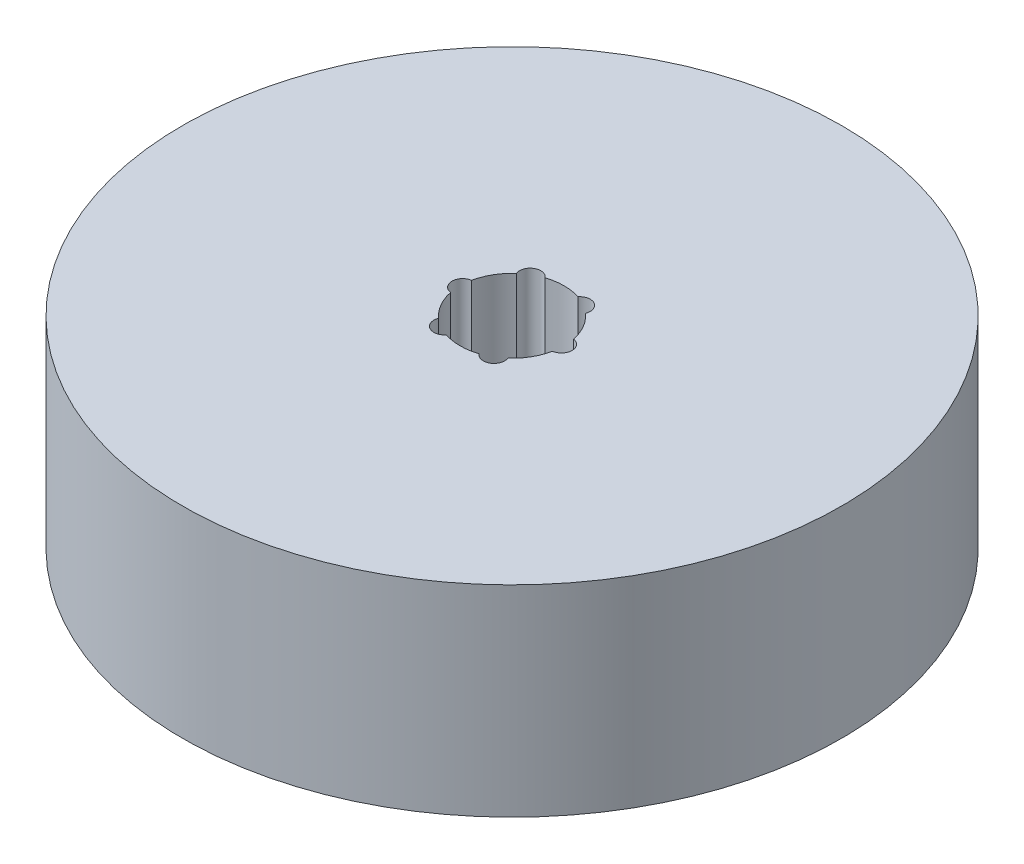
ISO-10303-21;
HEADER;
FILE_DESCRIPTION(('STEP AP214'),'2;1');
FILE_NAME('part.step','',(''),(''),'','','');
FILE_SCHEMA(('AUTOMOTIVE_DESIGN { 1 0 10303 214 1 1 1 1 }'));
ENDSEC;
DATA;
#1=APPLICATION_CONTEXT('core data for automotive mechanical design processes');
#2=APPLICATION_PROTOCOL_DEFINITION('international standard','automotive_design',2000,#1);
#3=PRODUCT_CONTEXT('',#1,'mechanical');
#4=PRODUCT('Part','Part','',(#3));
#5=PRODUCT_RELATED_PRODUCT_CATEGORY('part','',(#4));
#6=PRODUCT_DEFINITION_FORMATION('','',#4);
#7=PRODUCT_DEFINITION_CONTEXT('part definition',#1,'design');
#8=PRODUCT_DEFINITION('design','',#6,#7);
#9=PRODUCT_DEFINITION_SHAPE('','',#8);
#10=(LENGTH_UNIT() NAMED_UNIT(*) SI_UNIT(.MILLI.,.METRE.));
#11=(NAMED_UNIT(*) PLANE_ANGLE_UNIT() SI_UNIT($,.RADIAN.));
#12=(NAMED_UNIT(*) SI_UNIT($,.STERADIAN.) SOLID_ANGLE_UNIT());
#13=UNCERTAINTY_MEASURE_WITH_UNIT(LENGTH_MEASURE(1.E-05),#10,'distance_accuracy_value','');
#14=(GEOMETRIC_REPRESENTATION_CONTEXT(3) GLOBAL_UNCERTAINTY_ASSIGNED_CONTEXT((#13)) GLOBAL_UNIT_ASSIGNED_CONTEXT((#10,
#11,#12)) REPRESENTATION_CONTEXT('',''));
#15=CARTESIAN_POINT('',(0.,0.,0.));
#16=DIRECTION('',(0.,0.,1.));
#17=DIRECTION('',(1.,0.,0.));
#18=AXIS2_PLACEMENT_3D('',#15,#16,#17);
#19=CARTESIAN_POINT('',(0.,29.,0.));
#20=DIRECTION('',(0.,-1.,0.));
#21=DIRECTION('',(0.,0.,-1.));
#22=AXIS2_PLACEMENT_3D('',#19,#20,#21);
#23=CYLINDRICAL_SURFACE('',#22,47.5);
#24=CARTESIAN_POINT('',(0.,29.,0.));
#25=DIRECTION('',(0.,1.,0.));
#26=DIRECTION('',(0.,0.,1.));
#27=AXIS2_PLACEMENT_3D('',#24,#25,#26);
#28=CIRCLE('',#27,47.5);
#29=CARTESIAN_POINT('',(0.,29.,-47.5));
#30=VERTEX_POINT('',#29);
#31=EDGE_CURVE('E162',#30,#30,#28,.T.);
#32=CARTESIAN_POINT('',(0.,0.,0.));
#33=DIRECTION('',(0.,1.,0.));
#34=DIRECTION('',(0.,0.,1.));
#35=AXIS2_PLACEMENT_3D('',#32,#33,#34);
#36=CIRCLE('',#35,47.5);
#37=CARTESIAN_POINT('',(0.,0.,-47.5));
#38=VERTEX_POINT('',#37);
#39=EDGE_CURVE('E157',#38,#38,#36,.T.);
#40=CARTESIAN_POINT('',(0.,29.,-47.5));
#41=CARTESIAN_POINT('',(0.,28.6979166666667,-47.5));
#42=CARTESIAN_POINT('',(0.,28.3958333333333,-47.5));
#43=CARTESIAN_POINT('',(0.,27.7916666666667,-47.5));
#44=CARTESIAN_POINT('',(0.,27.4895833333333,-47.5));
#45=CARTESIAN_POINT('',(0.,26.8854166666667,-47.5));
#46=CARTESIAN_POINT('',(0.,26.5833333333333,-47.5));
#47=CARTESIAN_POINT('',(0.,25.9791666666667,-47.5));
#48=CARTESIAN_POINT('',(0.,25.6770833333333,-47.5));
#49=CARTESIAN_POINT('',(0.,25.0729166666667,-47.5));
#50=CARTESIAN_POINT('',(0.,24.7708333333333,-47.5));
#51=CARTESIAN_POINT('',(0.,24.1666666666667,-47.5));
#52=CARTESIAN_POINT('',(0.,23.8645833333333,-47.5));
#53=CARTESIAN_POINT('',(0.,23.2604166666667,-47.5));
#54=CARTESIAN_POINT('',(0.,22.9583333333333,-47.5));
#55=CARTESIAN_POINT('',(0.,22.3541666666667,-47.5));
#56=CARTESIAN_POINT('',(0.,22.0520833333333,-47.5));
#57=CARTESIAN_POINT('',(0.,21.4479166666667,-47.5));
#58=CARTESIAN_POINT('',(0.,21.1458333333333,-47.5));
#59=CARTESIAN_POINT('',(0.,20.5416666666667,-47.5));
#60=CARTESIAN_POINT('',(0.,20.2395833333333,-47.5));
#61=CARTESIAN_POINT('',(0.,19.6354166666667,-47.5));
#62=CARTESIAN_POINT('',(0.,19.3333333333333,-47.5));
#63=CARTESIAN_POINT('',(0.,18.7291666666667,-47.5));
#64=CARTESIAN_POINT('',(0.,18.4270833333333,-47.5));
#65=CARTESIAN_POINT('',(0.,17.8229166666667,-47.5));
#66=CARTESIAN_POINT('',(0.,17.5208333333333,-47.5));
#67=CARTESIAN_POINT('',(0.,16.9166666666667,-47.5));
#68=CARTESIAN_POINT('',(0.,16.6145833333333,-47.5));
#69=CARTESIAN_POINT('',(0.,16.0104166666667,-47.5));
#70=CARTESIAN_POINT('',(0.,15.7083333333333,-47.5));
#71=CARTESIAN_POINT('',(0.,15.1041666666667,-47.5));
#72=CARTESIAN_POINT('',(0.,14.8020833333333,-47.5));
#73=CARTESIAN_POINT('',(0.,14.1979166666667,-47.5));
#74=CARTESIAN_POINT('',(0.,13.8958333333333,-47.5));
#75=CARTESIAN_POINT('',(0.,13.2916666666667,-47.5));
#76=CARTESIAN_POINT('',(0.,12.9895833333333,-47.5));
#77=CARTESIAN_POINT('',(0.,12.3854166666667,-47.5));
#78=CARTESIAN_POINT('',(0.,12.0833333333333,-47.5));
#79=CARTESIAN_POINT('',(0.,11.4791666666667,-47.5));
#80=CARTESIAN_POINT('',(0.,11.1770833333333,-47.5));
#81=CARTESIAN_POINT('',(0.,10.5729166666667,-47.5));
#82=CARTESIAN_POINT('',(0.,10.2708333333333,-47.5));
#83=CARTESIAN_POINT('',(0.,9.66666666666667,-47.5));
#84=CARTESIAN_POINT('',(0.,9.36458333333333,-47.5));
#85=CARTESIAN_POINT('',(0.,8.76041666666667,-47.5));
#86=CARTESIAN_POINT('',(0.,8.45833333333333,-47.5));
#87=CARTESIAN_POINT('',(0.,7.85416666666667,-47.5));
#88=CARTESIAN_POINT('',(0.,7.55208333333333,-47.5));
#89=CARTESIAN_POINT('',(0.,6.94791666666667,-47.5));
#90=CARTESIAN_POINT('',(0.,6.64583333333333,-47.5));
#91=CARTESIAN_POINT('',(0.,6.04166666666667,-47.5));
#92=CARTESIAN_POINT('',(0.,5.73958333333333,-47.5));
#93=CARTESIAN_POINT('',(0.,5.13541666666667,-47.5));
#94=CARTESIAN_POINT('',(0.,4.83333333333333,-47.5));
#95=CARTESIAN_POINT('',(0.,4.22916666666667,-47.5));
#96=CARTESIAN_POINT('',(0.,3.92708333333333,-47.5));
#97=CARTESIAN_POINT('',(0.,3.32291666666667,-47.5));
#98=CARTESIAN_POINT('',(0.,3.02083333333333,-47.5));
#99=CARTESIAN_POINT('',(0.,2.41666666666667,-47.5));
#100=CARTESIAN_POINT('',(0.,2.11458333333333,-47.5));
#101=CARTESIAN_POINT('',(0.,1.51041666666667,-47.5));
#102=CARTESIAN_POINT('',(0.,1.20833333333333,-47.5));
#103=CARTESIAN_POINT('',(0.,0.604166666666667,-47.5));
#104=CARTESIAN_POINT('',(0.,0.302083333333333,-47.5));
#105=CARTESIAN_POINT('',(0.,0.,-47.5));
#106=B_SPLINE_CURVE_WITH_KNOTS('',3,(#40,#41,#42,#43,#44,#45,#46,#47,#48,#49,#50,#51,#52,#53,
#54,#55,#56,#57,#58,#59,#60,#61,#62,#63,#64,#65,#66,#67,#68,#69,#70,#71,#72,#73,#74,#75,#76,#77,
#78,#79,#80,#81,#82,#83,#84,#85,#86,#87,#88,#89,#90,#91,#92,#93,#94,#95,#96,#97,#98,#99,#100,
#101,#102,#103,#104,#105),.UNSPECIFIED.,.F.,.F.,(4,2,2,2,2,2,2,2,2,2,2,2,2,2,2,2,2,2,2,2,2,2,2,
2,2,2,2,2,2,2,2,2,4),(0.,0.906249999999997,1.8125,2.71875,3.625,4.53125,5.4375,6.34375,7.25,
8.15625,9.0625,9.96875,10.875,11.78125,12.6875,13.59375,14.5,15.40625,16.3125,17.21875,18.125,
19.03125,19.9375,20.84375,21.75,22.65625,23.5625,24.46875,25.375,26.28125,27.1875,28.09375,29.),.UNSPECIFIED.);
#107=EDGE_CURVE('BSEAM39',#30,#38,#106,.T.);
#108=ORIENTED_EDGE('',*,*,#31,.F.);
#109=ORIENTED_EDGE('',*,*,#39,.T.);
#110=ORIENTED_EDGE('',*,*,#107,.T.);
#111=ORIENTED_EDGE('',*,*,#107,.F.);
#112=EDGE_LOOP('',(#108,#110,#109,#111));
#113=FACE_BOUND('',#112,.T.);
#114=ADVANCED_FACE('F39',(#113),#23,.T.);
#115=CARTESIAN_POINT('',(0.,29.,0.));
#116=DIRECTION('',(0.,1.,0.));
#117=DIRECTION('',(0.,0.,1.));
#118=AXIS2_PLACEMENT_3D('',#115,#116,#117);
#119=PLANE('',#118);
#120=CARTESIAN_POINT('',(-3.56245710379145,29.,-6.17035670355129));
#121=DIRECTION('',(0.,1.,0.));
#122=DIRECTION('',(-0.866025403784433,0.,0.50000000000001));
#123=AXIS2_PLACEMENT_3D('',#120,#121,#122);
#124=CIRCLE('',#123,1.5335488822873);
#125=CARTESIAN_POINT('',(-2.35805217393656,29.,-7.11966220722536));
#126=VERTEX_POINT('',#125);
#127=CARTESIAN_POINT('',(-4.986782250853,29.,-5.60196418969075));
#128=VERTEX_POINT('',#127);
#129=EDGE_CURVE('E218',#126,#128,#124,.T.);
#130=ORIENTED_EDGE('',*,*,#129,.F.);
#131=CARTESIAN_POINT('',(0.,29.,0.));
#132=DIRECTION('',(0.,1.,0.));
#133=DIRECTION('',(0.,0.,1.));
#134=AXIS2_PLACEMENT_3D('',#131,#132,#133);
#135=CIRCLE('',#134,7.5);
#136=CARTESIAN_POINT('',(2.35805217393641,29.,-7.11966220722541));
#137=VERTEX_POINT('',#136);
#138=EDGE_CURVE('E169',#137,#126,#135,.T.);
#139=ORIENTED_EDGE('',*,*,#138,.F.);
#140=CARTESIAN_POINT('',(3.56245710379132,29.,-6.17035670355137));
#141=DIRECTION('',(0.,1.,0.));
#142=DIRECTION('',(-0.866025403784443,0.,-0.499999999999992));
#143=AXIS2_PLACEMENT_3D('',#140,#141,#142);
#144=CIRCLE('',#143,1.5335488822873);
#145=CARTESIAN_POINT('',(4.98678225085288,29.,-5.60196418969085));
#146=VERTEX_POINT('',#145);
#147=EDGE_CURVE('E285',#146,#137,#144,.T.);
#148=ORIENTED_EDGE('',*,*,#147,.F.);
#149=CARTESIAN_POINT('',(7.34483442478941,29.,-1.51769801753458));
#150=VERTEX_POINT('',#149);
#151=EDGE_CURVE('E174',#150,#146,#135,.T.);
#152=ORIENTED_EDGE('',*,*,#151,.F.);
#153=CARTESIAN_POINT('',(7.12491420758275,29.,0.));
#154=DIRECTION('',(0.,1.,0.));
#155=DIRECTION('',(0.,0.,-1.));
#156=AXIS2_PLACEMENT_3D('',#153,#154,#155);
#157=CIRCLE('',#156,1.5335488822873);
#158=CARTESIAN_POINT('',(7.34483442478941,29.,1.51769801753458));
#159=VERTEX_POINT('',#158);
#160=EDGE_CURVE('E280',#159,#150,#157,.T.);
#161=ORIENTED_EDGE('',*,*,#160,.F.);
#162=CARTESIAN_POINT('',(4.98678225085296,29.,5.60196418969078));
#163=VERTEX_POINT('',#162);
#164=EDGE_CURVE('E164',#163,#159,#135,.T.);
#165=ORIENTED_EDGE('',*,*,#164,.F.);
#166=CARTESIAN_POINT('',(3.56245710379141,29.,6.17035670355132));
#167=DIRECTION('',(0.,1.,0.));
#168=DIRECTION('',(0.866025403784436,0.,-0.500000000000004));
#169=AXIS2_PLACEMENT_3D('',#166,#167,#168);
#170=CIRCLE('',#169,1.5335488822873);
#171=CARTESIAN_POINT('',(2.35805217393651,29.,7.11966220722537));
#172=VERTEX_POINT('',#171);
#173=EDGE_CURVE('E269',#172,#163,#170,.T.);
#174=ORIENTED_EDGE('',*,*,#173,.F.);
#175=CARTESIAN_POINT('',(-2.35805217393646,29.,7.11966220722539));
#176=VERTEX_POINT('',#175);
#177=EDGE_CURVE('E149',#176,#172,#135,.T.);
#178=ORIENTED_EDGE('',*,*,#177,.F.);
#179=CARTESIAN_POINT('',(-3.56245710379136,29.,6.17035670355135));
#180=DIRECTION('',(0.,1.,0.));
#181=DIRECTION('',(0.86602540378444,0.,0.499999999999998));
#182=AXIS2_PLACEMENT_3D('',#179,#180,#181);
#183=CIRCLE('',#182,1.5335488822873);
#184=CARTESIAN_POINT('',(-4.98678225085292,29.,5.60196418969082));
#185=VERTEX_POINT('',#184);
#186=EDGE_CURVE('E128',#185,#176,#183,.T.);
#187=ORIENTED_EDGE('',*,*,#186,.F.);
#188=CARTESIAN_POINT('',(-7.34483442478941,29.,1.51769801753458));
#189=VERTEX_POINT('',#188);
#190=EDGE_CURVE('E148',#189,#185,#135,.T.);
#191=ORIENTED_EDGE('',*,*,#190,.F.);
#192=CARTESIAN_POINT('',(-7.12491420758275,29.,0.));
#193=DIRECTION('',(0.,1.,0.));
#194=DIRECTION('',(0.,0.,1.));
#195=AXIS2_PLACEMENT_3D('',#192,#193,#194);
#196=CIRCLE('',#195,1.5335488822873);
#197=CARTESIAN_POINT('',(-7.34483442478941,29.,-1.51769801753458));
#198=VERTEX_POINT('',#197);
#199=EDGE_CURVE('E179',#198,#189,#196,.T.);
#200=ORIENTED_EDGE('',*,*,#199,.F.);
#201=EDGE_CURVE('E161',#128,#198,#135,.T.);
#202=ORIENTED_EDGE('',*,*,#201,.F.);
#203=EDGE_LOOP('',(#130,#139,#148,#152,#161,#165,#174,#178,#187,#191,#200,#202));
#204=FACE_BOUND('',#203,.T.);
#205=ORIENTED_EDGE('',*,*,#31,.T.);
#206=EDGE_LOOP('',(#205));
#207=FACE_BOUND('',#206,.T.);
#208=ADVANCED_FACE('F141',(#204,#207),#119,.T.);
#209=CARTESIAN_POINT('',(0.,0.,0.));
#210=DIRECTION('',(0.,1.,0.));
#211=DIRECTION('',(0.,0.,1.));
#212=AXIS2_PLACEMENT_3D('',#209,#210,#211);
#213=PLANE('',#212);
#214=CARTESIAN_POINT('',(0.,0.,0.));
#215=DIRECTION('',(0.,1.,0.));
#216=DIRECTION('',(0.,0.,1.));
#217=AXIS2_PLACEMENT_3D('',#214,#215,#216);
#218=CIRCLE('',#217,7.5);
#219=CARTESIAN_POINT('',(0.,0.,7.5));
#220=VERTEX_POINT('',#219);
#221=EDGE_CURVE('E166',#220,#220,#218,.T.);
#222=ORIENTED_EDGE('',*,*,#221,.T.);
#223=EDGE_LOOP('',(#222));
#224=FACE_BOUND('',#223,.T.);
#225=ORIENTED_EDGE('',*,*,#39,.F.);
#226=EDGE_LOOP('',(#225));
#227=FACE_BOUND('',#226,.T.);
#228=ADVANCED_FACE('F234',(#224,#227),#213,.F.);
#229=CARTESIAN_POINT('',(0.,29.,0.));
#230=DIRECTION('',(0.,-1.,0.));
#231=DIRECTION('',(0.,0.,-1.));
#232=AXIS2_PLACEMENT_3D('',#229,#230,#231);
#233=CYLINDRICAL_SURFACE('',#232,7.5);
#234=DIRECTION('',(0.,1.,0.));
#235=VECTOR('',#234,1.);
#236=CARTESIAN_POINT('',(-2.35805217393656,15.7410644368105,-7.11966220722536));
#237=LINE('',#236,#235);
#238=CARTESIAN_POINT('',(-2.35805217393656,2.48212887362102,-7.11966220722536));
#239=VERTEX_POINT('',#238);
#240=EDGE_CURVE('E11',#239,#126,#237,.T.);
#241=ORIENTED_EDGE('',*,*,#240,.F.);
#242=CARTESIAN_POINT('',(0.,2.48212887362102,0.));
#243=DIRECTION('',(0.,1.,0.));
#244=DIRECTION('',(0.,0.,1.));
#245=AXIS2_PLACEMENT_3D('',#242,#243,#244);
#246=CIRCLE('',#245,7.5);
#247=CARTESIAN_POINT('',(-4.986782250853,2.48212887362102,-5.60196418969075));
#248=VERTEX_POINT('',#247);
#249=EDGE_CURVE('E214',#239,#248,#246,.T.);
#250=ORIENTED_EDGE('',*,*,#249,.T.);
#251=DIRECTION('',(0.,1.,0.));
#252=VECTOR('',#251,1.);
#253=CARTESIAN_POINT('',(-4.986782250853,15.7410644368105,-5.60196418969075));
#254=LINE('',#253,#252);
#255=EDGE_CURVE('E46',#128,#248,#254,.F.);
#256=ORIENTED_EDGE('',*,*,#255,.F.);
#257=ORIENTED_EDGE('',*,*,#201,.T.);
#258=DIRECTION('',(0.,1.,0.));
#259=VECTOR('',#258,1.);
#260=CARTESIAN_POINT('',(-7.34483442478941,15.7410644368105,-1.51769801753458));
#261=LINE('',#260,#259);
#262=CARTESIAN_POINT('',(-7.34483442478941,2.48212887362102,-1.51769801753458));
#263=VERTEX_POINT('',#262);
#264=EDGE_CURVE('E187',#263,#198,#261,.T.);
#265=ORIENTED_EDGE('',*,*,#264,.F.);
#266=CARTESIAN_POINT('',(0.,2.48212887362102,0.));
#267=DIRECTION('',(0.,1.,0.));
#268=DIRECTION('',(0.,0.,1.));
#269=AXIS2_PLACEMENT_3D('',#266,#267,#268);
#270=CIRCLE('',#269,7.5);
#271=CARTESIAN_POINT('',(-7.34483442478941,2.48212887362102,1.51769801753458));
#272=VERTEX_POINT('',#271);
#273=EDGE_CURVE('E184',#263,#272,#270,.T.);
#274=ORIENTED_EDGE('',*,*,#273,.T.);
#275=DIRECTION('',(0.,1.,0.));
#276=VECTOR('',#275,1.);
#277=CARTESIAN_POINT('',(-7.34483442478941,15.7410644368105,1.51769801753458));
#278=LINE('',#277,#276);
#279=EDGE_CURVE('E158',#189,#272,#278,.F.);
#280=ORIENTED_EDGE('',*,*,#279,.F.);
#281=ORIENTED_EDGE('',*,*,#190,.T.);
#282=DIRECTION('',(0.,1.,0.));
#283=VECTOR('',#282,1.);
#284=CARTESIAN_POINT('',(-4.98678225085292,15.7410644368105,5.60196418969082));
#285=LINE('',#284,#283);
#286=CARTESIAN_POINT('',(-4.98678225085292,2.48212887362102,5.60196418969082));
#287=VERTEX_POINT('',#286);
#288=EDGE_CURVE('E127',#287,#185,#285,.T.);
#289=ORIENTED_EDGE('',*,*,#288,.F.);
#290=CARTESIAN_POINT('',(0.,2.48212887362102,0.));
#291=DIRECTION('',(0.,1.,0.));
#292=DIRECTION('',(0.,0.,1.));
#293=AXIS2_PLACEMENT_3D('',#290,#291,#292);
#294=CIRCLE('',#293,7.5);
#295=CARTESIAN_POINT('',(-2.35805217393646,2.48212887362102,7.11966220722539));
#296=VERTEX_POINT('',#295);
#297=EDGE_CURVE('E189',#287,#296,#294,.T.);
#298=ORIENTED_EDGE('',*,*,#297,.T.);
#299=DIRECTION('',(0.,1.,0.));
#300=VECTOR('',#299,1.);
#301=CARTESIAN_POINT('',(-2.35805217393646,15.7410644368105,7.11966220722539));
#302=LINE('',#301,#300);
#303=EDGE_CURVE('E140',#176,#296,#302,.F.);
#304=ORIENTED_EDGE('',*,*,#303,.F.);
#305=ORIENTED_EDGE('',*,*,#177,.T.);
#306=DIRECTION('',(0.,1.,0.));
#307=VECTOR('',#306,1.);
#308=CARTESIAN_POINT('',(2.35805217393651,15.7410644368105,7.11966220722537));
#309=LINE('',#308,#307);
#310=CARTESIAN_POINT('',(2.35805217393651,2.48212887362102,7.11966220722537));
#311=VERTEX_POINT('',#310);
#312=EDGE_CURVE('E196',#311,#172,#309,.T.);
#313=ORIENTED_EDGE('',*,*,#312,.F.);
#314=CARTESIAN_POINT('',(0.,2.48212887362102,0.));
#315=DIRECTION('',(0.,1.,0.));
#316=DIRECTION('',(0.,0.,1.));
#317=AXIS2_PLACEMENT_3D('',#314,#315,#316);
#318=CIRCLE('',#317,7.5);
#319=CARTESIAN_POINT('',(4.98678225085296,2.48212887362102,5.60196418969078));
#320=VERTEX_POINT('',#319);
#321=EDGE_CURVE('E136',#311,#320,#318,.T.);
#322=ORIENTED_EDGE('',*,*,#321,.T.);
#323=DIRECTION('',(0.,1.,0.));
#324=VECTOR('',#323,1.);
#325=CARTESIAN_POINT('',(4.98678225085296,15.7410644368105,5.60196418969078));
#326=LINE('',#325,#324);
#327=EDGE_CURVE('E194',#163,#320,#326,.F.);
#328=ORIENTED_EDGE('',*,*,#327,.F.);
#329=ORIENTED_EDGE('',*,*,#164,.T.);
#330=DIRECTION('',(0.,1.,0.));
#331=VECTOR('',#330,1.);
#332=CARTESIAN_POINT('',(7.34483442478941,15.7410644368105,1.51769801753458));
#333=LINE('',#332,#331);
#334=CARTESIAN_POINT('',(7.34483442478941,2.48212887362102,1.51769801753458));
#335=VERTEX_POINT('',#334);
#336=EDGE_CURVE('E206',#335,#159,#333,.T.);
#337=ORIENTED_EDGE('',*,*,#336,.F.);
#338=CARTESIAN_POINT('',(0.,2.48212887362102,0.));
#339=DIRECTION('',(0.,1.,0.));
#340=DIRECTION('',(0.,0.,1.));
#341=AXIS2_PLACEMENT_3D('',#338,#339,#340);
#342=CIRCLE('',#341,7.5);
#343=CARTESIAN_POINT('',(7.34483442478941,2.48212887362102,-1.51769801753458));
#344=VERTEX_POINT('',#343);
#345=EDGE_CURVE('E199',#335,#344,#342,.T.);
#346=ORIENTED_EDGE('',*,*,#345,.T.);
#347=DIRECTION('',(0.,1.,0.));
#348=VECTOR('',#347,1.);
#349=CARTESIAN_POINT('',(7.34483442478941,15.7410644368105,-1.51769801753458));
#350=LINE('',#349,#348);
#351=EDGE_CURVE('E201',#150,#344,#350,.F.);
#352=ORIENTED_EDGE('',*,*,#351,.F.);
#353=ORIENTED_EDGE('',*,*,#151,.T.);
#354=DIRECTION('',(0.,1.,0.));
#355=VECTOR('',#354,1.);
#356=CARTESIAN_POINT('',(4.98678225085288,15.7410644368105,-5.60196418969085));
#357=LINE('',#356,#355);
#358=CARTESIAN_POINT('',(4.98678225085288,2.48212887362102,-5.60196418969085));
#359=VERTEX_POINT('',#358);
#360=EDGE_CURVE('E213',#359,#146,#357,.T.);
#361=ORIENTED_EDGE('',*,*,#360,.F.);
#362=CARTESIAN_POINT('',(0.,2.48212887362102,0.));
#363=DIRECTION('',(0.,1.,0.));
#364=DIRECTION('',(0.,0.,1.));
#365=AXIS2_PLACEMENT_3D('',#362,#363,#364);
#366=CIRCLE('',#365,7.5);
#367=CARTESIAN_POINT('',(2.35805217393641,2.48212887362102,-7.11966220722541));
#368=VERTEX_POINT('',#367);
#369=EDGE_CURVE('E208',#359,#368,#366,.T.);
#370=ORIENTED_EDGE('',*,*,#369,.T.);
#371=DIRECTION('',(0.,1.,0.));
#372=VECTOR('',#371,1.);
#373=CARTESIAN_POINT('',(2.35805217393641,15.7410644368105,-7.11966220722541));
#374=LINE('',#373,#372);
#375=EDGE_CURVE('E211',#137,#368,#374,.F.);
#376=ORIENTED_EDGE('',*,*,#375,.F.);
#377=ORIENTED_EDGE('',*,*,#138,.T.);
#378=EDGE_LOOP('',(#241,#250,#256,#257,#265,#274,#280,#281,#289,#298,#304,#305,#313,#322,#328,
#329,#337,#346,#352,#353,#361,#370,#376,#377));
#379=FACE_BOUND('',#378,.T.);
#380=ORIENTED_EDGE('',*,*,#221,.F.);
#381=EDGE_LOOP('',(#380));
#382=FACE_BOUND('',#381,.T.);
#383=ADVANCED_FACE('F152',(#379,#382),#233,.F.);
#384=CARTESIAN_POINT('',(-7.12491420758275,2.48212887362102,0.));
#385=DIRECTION('',(0.,1.,0.));
#386=DIRECTION('',(0.,0.,1.));
#387=AXIS2_PLACEMENT_3D('',#384,#385,#386);
#388=CYLINDRICAL_SURFACE('',#387,1.5335488822873);
#389=ORIENTED_EDGE('',*,*,#264,.T.);
#390=ORIENTED_EDGE('',*,*,#199,.T.);
#391=ORIENTED_EDGE('',*,*,#279,.T.);
#392=CARTESIAN_POINT('',(-7.12491420758275,2.48212887362102,0.));
#393=DIRECTION('',(0.,1.,0.));
#394=DIRECTION('',(0.,0.,1.));
#395=AXIS2_PLACEMENT_3D('',#392,#393,#394);
#396=CIRCLE('',#395,1.5335488822873);
#397=EDGE_CURVE('E180',#263,#272,#396,.T.);
#398=ORIENTED_EDGE('',*,*,#397,.F.);
#399=EDGE_LOOP('',(#389,#390,#391,#398));
#400=FACE_BOUND('',#399,.T.);
#401=ADVANCED_FACE('F244',(#400),#388,.F.);
#402=CARTESIAN_POINT('',(-7.12491420758275,2.48212887362102,0.));
#403=DIRECTION('',(0.,1.,0.));
#404=DIRECTION('',(0.,0.,1.));
#405=AXIS2_PLACEMENT_3D('',#402,#403,#404);
#406=PLANE('',#405);
#407=ORIENTED_EDGE('',*,*,#397,.T.);
#408=ORIENTED_EDGE('',*,*,#273,.F.);
#409=EDGE_LOOP('',(#407,#408));
#410=FACE_BOUND('',#409,.T.);
#411=ADVANCED_FACE('F248',(#410),#406,.T.);
#412=CARTESIAN_POINT('',(-3.56245710379136,2.48212887362102,6.17035670355135));
#413=DIRECTION('',(0.,1.,0.));
#414=DIRECTION('',(0.,0.,1.));
#415=AXIS2_PLACEMENT_3D('',#412,#413,#414);
#416=CYLINDRICAL_SURFACE('',#415,1.5335488822873);
#417=ORIENTED_EDGE('',*,*,#288,.T.);
#418=ORIENTED_EDGE('',*,*,#186,.T.);
#419=ORIENTED_EDGE('',*,*,#303,.T.);
#420=CARTESIAN_POINT('',(-3.56245710379136,2.48212887362102,6.17035670355135));
#421=DIRECTION('',(0.,1.,0.));
#422=DIRECTION('',(0.86602540378444,0.,0.499999999999998));
#423=AXIS2_PLACEMENT_3D('',#420,#421,#422);
#424=CIRCLE('',#423,1.5335488822873);
#425=EDGE_CURVE('E135',#287,#296,#424,.T.);
#426=ORIENTED_EDGE('',*,*,#425,.F.);
#427=EDGE_LOOP('',(#417,#418,#419,#426));
#428=FACE_BOUND('',#427,.T.);
#429=ADVANCED_FACE('F126',(#428),#416,.F.);
#430=CARTESIAN_POINT('',(-3.56245710379136,2.48212887362102,6.17035670355135));
#431=DIRECTION('',(0.,1.,0.));
#432=DIRECTION('',(0.86602540378444,0.,0.499999999999998));
#433=AXIS2_PLACEMENT_3D('',#430,#431,#432);
#434=PLANE('',#433);
#435=ORIENTED_EDGE('',*,*,#425,.T.);
#436=ORIENTED_EDGE('',*,*,#297,.F.);
#437=EDGE_LOOP('',(#435,#436));
#438=FACE_BOUND('',#437,.T.);
#439=ADVANCED_FACE('F258',(#438),#434,.T.);
#440=CARTESIAN_POINT('',(3.56245710379141,2.48212887362102,6.17035670355132));
#441=DIRECTION('',(0.,1.,0.));
#442=DIRECTION('',(0.,0.,1.));
#443=AXIS2_PLACEMENT_3D('',#440,#441,#442);
#444=CYLINDRICAL_SURFACE('',#443,1.5335488822873);
#445=ORIENTED_EDGE('',*,*,#312,.T.);
#446=ORIENTED_EDGE('',*,*,#173,.T.);
#447=ORIENTED_EDGE('',*,*,#327,.T.);
#448=CARTESIAN_POINT('',(3.56245710379141,2.48212887362102,6.17035670355132));
#449=DIRECTION('',(0.,1.,0.));
#450=DIRECTION('',(0.866025403784436,0.,-0.500000000000004));
#451=AXIS2_PLACEMENT_3D('',#448,#449,#450);
#452=CIRCLE('',#451,1.5335488822873);
#453=EDGE_CURVE('E147',#311,#320,#452,.T.);
#454=ORIENTED_EDGE('',*,*,#453,.F.);
#455=EDGE_LOOP('',(#445,#446,#447,#454));
#456=FACE_BOUND('',#455,.T.);
#457=ADVANCED_FACE('F256',(#456),#444,.F.);
#458=CARTESIAN_POINT('',(3.56245710379141,2.48212887362102,6.17035670355132));
#459=DIRECTION('',(0.,1.,0.));
#460=DIRECTION('',(0.866025403784436,0.,-0.500000000000004));
#461=AXIS2_PLACEMENT_3D('',#458,#459,#460);
#462=PLANE('',#461);
#463=ORIENTED_EDGE('',*,*,#453,.T.);
#464=ORIENTED_EDGE('',*,*,#321,.F.);
#465=EDGE_LOOP('',(#463,#464));
#466=FACE_BOUND('',#465,.T.);
#467=ADVANCED_FACE('F263',(#466),#462,.T.);
#468=CARTESIAN_POINT('',(7.12491420758275,2.48212887362102,0.));
#469=DIRECTION('',(0.,1.,0.));
#470=DIRECTION('',(0.,0.,1.));
#471=AXIS2_PLACEMENT_3D('',#468,#469,#470);
#472=CYLINDRICAL_SURFACE('',#471,1.5335488822873);
#473=ORIENTED_EDGE('',*,*,#336,.T.);
#474=ORIENTED_EDGE('',*,*,#160,.T.);
#475=ORIENTED_EDGE('',*,*,#351,.T.);
#476=CARTESIAN_POINT('',(7.12491420758275,2.48212887362102,0.));
#477=DIRECTION('',(0.,1.,0.));
#478=DIRECTION('',(0.,0.,-1.));
#479=AXIS2_PLACEMENT_3D('',#476,#477,#478);
#480=CIRCLE('',#479,1.5335488822873);
#481=EDGE_CURVE('E273',#335,#344,#480,.T.);
#482=ORIENTED_EDGE('',*,*,#481,.F.);
#483=EDGE_LOOP('',(#473,#474,#475,#482));
#484=FACE_BOUND('',#483,.T.);
#485=ADVANCED_FACE('F297',(#484),#472,.F.);
#486=CARTESIAN_POINT('',(7.12491420758275,2.48212887362102,0.));
#487=DIRECTION('',(0.,1.,0.));
#488=DIRECTION('',(0.,0.,-1.));
#489=AXIS2_PLACEMENT_3D('',#486,#487,#488);
#490=PLANE('',#489);
#491=ORIENTED_EDGE('',*,*,#481,.T.);
#492=ORIENTED_EDGE('',*,*,#345,.F.);
#493=EDGE_LOOP('',(#491,#492));
#494=FACE_BOUND('',#493,.T.);
#495=ADVANCED_FACE('F299',(#494),#490,.T.);
#496=CARTESIAN_POINT('',(3.56245710379132,2.48212887362102,-6.17035670355137));
#497=DIRECTION('',(0.,1.,0.));
#498=DIRECTION('',(0.,0.,1.));
#499=AXIS2_PLACEMENT_3D('',#496,#497,#498);
#500=CYLINDRICAL_SURFACE('',#499,1.5335488822873);
#501=ORIENTED_EDGE('',*,*,#360,.T.);
#502=ORIENTED_EDGE('',*,*,#147,.T.);
#503=ORIENTED_EDGE('',*,*,#375,.T.);
#504=CARTESIAN_POINT('',(3.56245710379132,2.48212887362102,-6.17035670355137));
#505=DIRECTION('',(0.,1.,0.));
#506=DIRECTION('',(-0.866025403784443,0.,-0.499999999999992));
#507=AXIS2_PLACEMENT_3D('',#504,#505,#506);
#508=CIRCLE('',#507,1.5335488822873);
#509=EDGE_CURVE('E56',#359,#368,#508,.T.);
#510=ORIENTED_EDGE('',*,*,#509,.F.);
#511=EDGE_LOOP('',(#501,#502,#503,#510));
#512=FACE_BOUND('',#511,.T.);
#513=ADVANCED_FACE('F292',(#512),#500,.F.);
#514=CARTESIAN_POINT('',(3.56245710379132,2.48212887362102,-6.17035670355137));
#515=DIRECTION('',(0.,1.,0.));
#516=DIRECTION('',(-0.866025403784443,0.,-0.499999999999992));
#517=AXIS2_PLACEMENT_3D('',#514,#515,#516);
#518=PLANE('',#517);
#519=ORIENTED_EDGE('',*,*,#509,.T.);
#520=ORIENTED_EDGE('',*,*,#369,.F.);
#521=EDGE_LOOP('',(#519,#520));
#522=FACE_BOUND('',#521,.T.);
#523=ADVANCED_FACE('F226',(#522),#518,.T.);
#524=CARTESIAN_POINT('',(-3.56245710379145,2.48212887362102,-6.17035670355129));
#525=DIRECTION('',(0.,1.,0.));
#526=DIRECTION('',(0.,0.,1.));
#527=AXIS2_PLACEMENT_3D('',#524,#525,#526);
#528=CYLINDRICAL_SURFACE('',#527,1.5335488822873);
#529=ORIENTED_EDGE('',*,*,#240,.T.);
#530=ORIENTED_EDGE('',*,*,#129,.T.);
#531=ORIENTED_EDGE('',*,*,#255,.T.);
#532=CARTESIAN_POINT('',(-3.56245710379145,2.48212887362102,-6.17035670355129));
#533=DIRECTION('',(0.,1.,0.));
#534=DIRECTION('',(-0.866025403784433,0.,0.50000000000001));
#535=AXIS2_PLACEMENT_3D('',#532,#533,#534);
#536=CIRCLE('',#535,1.5335488822873);
#537=EDGE_CURVE('E55',#239,#248,#536,.T.);
#538=ORIENTED_EDGE('',*,*,#537,.F.);
#539=EDGE_LOOP('',(#529,#530,#531,#538));
#540=FACE_BOUND('',#539,.T.);
#541=ADVANCED_FACE('F217',(#540),#528,.F.);
#542=CARTESIAN_POINT('',(-3.56245710379145,2.48212887362102,-6.17035670355129));
#543=DIRECTION('',(0.,1.,0.));
#544=DIRECTION('',(-0.866025403784433,0.,0.50000000000001));
#545=AXIS2_PLACEMENT_3D('',#542,#543,#544);
#546=PLANE('',#545);
#547=ORIENTED_EDGE('',*,*,#537,.T.);
#548=ORIENTED_EDGE('',*,*,#249,.F.);
#549=EDGE_LOOP('',(#547,#548));
#550=FACE_BOUND('',#549,.T.);
#551=ADVANCED_FACE('F219',(#550),#546,.T.);
#552=CLOSED_SHELL('',(#114,#208,#228,#383,#401,#411,#429,#439,#457,#467,#485,#495,#513,#523,
#541,#551));
#553=MANIFOLD_SOLID_BREP('B2',#552);
#554=ADVANCED_BREP_SHAPE_REPRESENTATION('',(#18,#553),#14);
#555=SHAPE_DEFINITION_REPRESENTATION(#9,#554);
ENDSEC;
END-ISO-10303-21;
